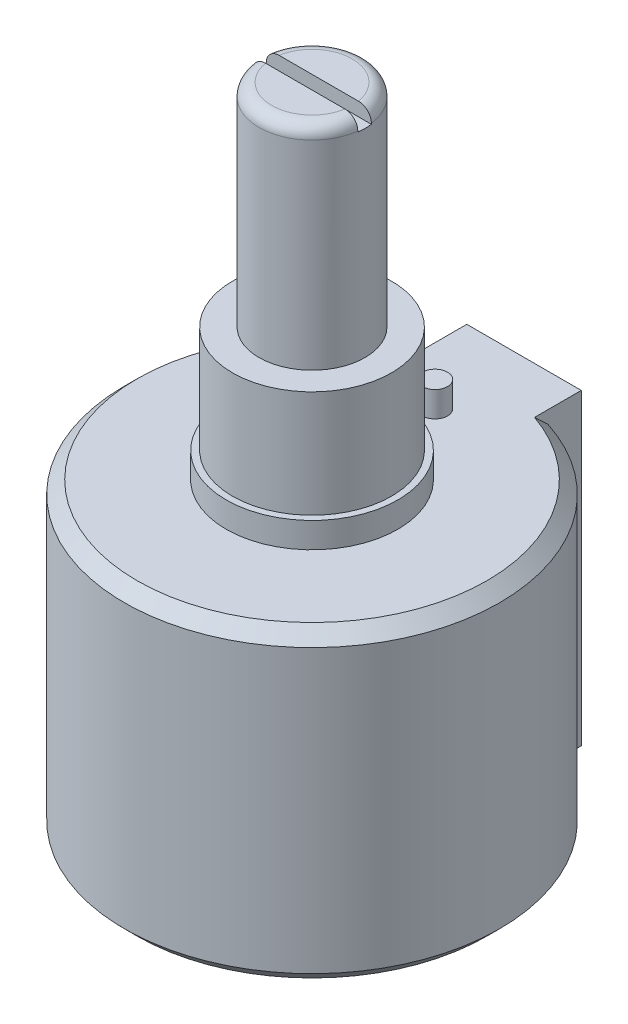
ISO-10303-21;
HEADER;
FILE_DESCRIPTION(('STEP AP214'),'2;1');
FILE_NAME('part.step','',(''),(''),'','','');
FILE_SCHEMA(('AUTOMOTIVE_DESIGN { 1 0 10303 214 1 1 1 1 }'));
ENDSEC;
DATA;
#1=APPLICATION_CONTEXT('core data for automotive mechanical design processes');
#2=APPLICATION_PROTOCOL_DEFINITION('international standard','automotive_design',2000,#1);
#3=PRODUCT_CONTEXT('',#1,'mechanical');
#4=PRODUCT('Part','Part','',(#3));
#5=PRODUCT_RELATED_PRODUCT_CATEGORY('part','',(#4));
#6=PRODUCT_DEFINITION_FORMATION('','',#4);
#7=PRODUCT_DEFINITION_CONTEXT('part definition',#1,'design');
#8=PRODUCT_DEFINITION('design','',#6,#7);
#9=PRODUCT_DEFINITION_SHAPE('','',#8);
#10=(LENGTH_UNIT() NAMED_UNIT(*) SI_UNIT(.MILLI.,.METRE.));
#11=(NAMED_UNIT(*) PLANE_ANGLE_UNIT() SI_UNIT($,.RADIAN.));
#12=(NAMED_UNIT(*) SI_UNIT($,.STERADIAN.) SOLID_ANGLE_UNIT());
#13=UNCERTAINTY_MEASURE_WITH_UNIT(LENGTH_MEASURE(1.E-05),#10,'distance_accuracy_value','');
#14=(GEOMETRIC_REPRESENTATION_CONTEXT(3) GLOBAL_UNCERTAINTY_ASSIGNED_CONTEXT((#13)) GLOBAL_UNIT_ASSIGNED_CONTEXT((#10,
#11,#12)) REPRESENTATION_CONTEXT('',''));
#15=CARTESIAN_POINT('',(0.,0.,0.));
#16=DIRECTION('',(0.,0.,1.));
#17=DIRECTION('',(1.,0.,0.));
#18=AXIS2_PLACEMENT_3D('',#15,#16,#17);
#19=CARTESIAN_POINT('',(0.,39.0652,0.));
#20=DIRECTION('',(0.,1.,0.));
#21=DIRECTION('',(0.,0.,1.));
#22=AXIS2_PLACEMENT_3D('',#19,#20,#21);
#23=PLANE('',#22);
#24=DIRECTION('',(-1.,0.,0.));
#25=VECTOR('',#24,1.);
#26=CARTESIAN_POINT('',(0.,39.0652,-0.406399999999999));
#27=LINE('',#26,#25);
#28=CARTESIAN_POINT('',(2.37853064726944,39.0652,-0.406399999999999));
#29=VERTEX_POINT('',#28);
#30=CARTESIAN_POINT('',(-2.37853064726944,39.0652,-0.406399999999999));
#31=VERTEX_POINT('',#30);
#32=EDGE_CURVE('E155',#29,#31,#27,.T.);
#33=ORIENTED_EDGE('',*,*,#32,.F.);
#34=CARTESIAN_POINT('',(0.,39.0652,0.));
#35=DIRECTION('',(0.,1.,0.));
#36=DIRECTION('',(0.,0.,1.));
#37=AXIS2_PLACEMENT_3D('',#34,#35,#36);
#38=CIRCLE('',#37,2.413);
#39=EDGE_CURVE('E213',#29,#31,#38,.T.);
#40=ORIENTED_EDGE('',*,*,#39,.T.);
#41=EDGE_LOOP('',(#33,#40));
#42=FACE_BOUND('',#41,.T.);
#43=ADVANCED_FACE('F35',(#42),#23,.T.);
#44=CARTESIAN_POINT('',(0.,38.3032,0.));
#45=DIRECTION('',(0.,1.,0.));
#46=DIRECTION('',(0.,0.,1.));
#47=AXIS2_PLACEMENT_3D('',#44,#45,#46);
#48=TOROIDAL_SURFACE('',#47,2.413,0.762);
#49=CARTESIAN_POINT('',(-3.02607236858328,38.7164029158338,-0.406399999999999));
#50=CARTESIAN_POINT('',(-3.04928885546917,38.6807466749942,-0.406399999999999));
#51=CARTESIAN_POINT('',(-3.06952177254155,38.6431123250831,-0.406399999999999));
#52=CARTESIAN_POINT('',(-3.10340243894063,38.5649520848089,-0.406399999999999));
#53=CARTESIAN_POINT('',(-3.11704275529472,38.5244229894951,-0.406399999999999));
#54=CARTESIAN_POINT('',(-3.13731148620609,38.441656801181,-0.406399999999999));
#55=CARTESIAN_POINT('',(-3.14394208031348,38.3994202433294,-0.406399999999999));
#56=CARTESIAN_POINT('',(-3.14999875276988,38.3144444027103,-0.406399999999999));
#57=CARTESIAN_POINT('',(-3.14942653289068,38.2717052410744,-0.406399999999999));
#58=CARTESIAN_POINT('',(-3.14110816073912,38.1870195034577,-0.406399999999999));
#59=CARTESIAN_POINT('',(-3.13337668577192,38.1450714850122,-0.406399999999999));
#60=CARTESIAN_POINT('',(-3.11098766779507,38.0630656787946,-0.406399999999999));
#61=CARTESIAN_POINT('',(-3.09632990074251,38.0230079522134,-0.406399999999999));
#62=CARTESIAN_POINT('',(-3.06049869537566,37.9458710402743,-0.406399999999999));
#63=CARTESIAN_POINT('',(-3.03931845615311,37.9087950150319,-0.406399999999999));
#64=CARTESIAN_POINT('',(-2.99106439466133,37.8387015542637,-0.406399999999999));
#65=CARTESIAN_POINT('',(-2.9639904753045,37.8056841856108,-0.406399999999999));
#66=CARTESIAN_POINT('',(-2.90457459423342,37.7444542670618,-0.406399999999999));
#67=CARTESIAN_POINT('',(-2.87220597123361,37.7162675945424,-0.406399999999999));
#68=CARTESIAN_POINT('',(-2.80323173899145,37.665672404991,-0.406399999999999));
#69=CARTESIAN_POINT('',(-2.76662597473297,37.6432640994581,-0.406399999999999));
#70=CARTESIAN_POINT('',(-2.68987221345261,37.6046422624446,-0.406399999999999));
#71=CARTESIAN_POINT('',(-2.64969561294179,37.5884855873229,-0.406399999999999));
#72=CARTESIAN_POINT('',(-2.5672193662397,37.5630626597329,-0.406399999999999));
#73=CARTESIAN_POINT('',(-2.52491959808366,37.5537968035904,-0.406399999999999));
#74=CARTESIAN_POINT('',(-2.43888661552915,37.5423065115134,-0.406399999999999));
#75=CARTESIAN_POINT('',(-2.39514259224402,37.5401630125027,-0.406399999999999));
#76=CARTESIAN_POINT('',(-2.30790554599542,37.5431669770856,-0.406399999999999));
#77=CARTESIAN_POINT('',(-2.26441253992709,37.5483149258267,-0.406399999999999));
#78=CARTESIAN_POINT('',(-2.17841701660583,37.5658292359713,-0.406399999999999));
#79=CARTESIAN_POINT('',(-2.13593016081474,37.5782725544259,-0.406399999999999));
#80=CARTESIAN_POINT('',(-2.05363029184255,37.6100828070075,-0.406399999999999));
#81=CARTESIAN_POINT('',(-2.01381742730532,37.6294501256533,-0.406399999999999));
#82=CARTESIAN_POINT('',(-1.93783235513034,37.6746804931109,-0.406399999999999));
#83=CARTESIAN_POINT('',(-1.90167667932273,37.7005713391968,-0.406399999999999));
#84=CARTESIAN_POINT('',(-1.83427409464975,37.7581090644821,-0.406399999999999));
#85=CARTESIAN_POINT('',(-1.80302709406933,37.7897558361125,-0.406399999999999));
#86=CARTESIAN_POINT('',(-1.74669129812605,37.857614277476,-0.406399999999999));
#87=CARTESIAN_POINT('',(-1.72154628425541,37.8937792267335,-0.406399999999999));
#88=CARTESIAN_POINT('',(-1.67786484878431,37.9699028421125,-0.406399999999999));
#89=CARTESIAN_POINT('',(-1.65932734621178,38.0098608863375,-0.406399999999999));
#90=CARTESIAN_POINT('',(-1.62989263336655,38.0913793397145,-0.406399999999999));
#91=CARTESIAN_POINT('',(-1.61881730966219,38.1328754154931,-0.406399999999999));
#92=CARTESIAN_POINT('',(-1.60398585541053,38.2171537011806,-0.406399999999999));
#93=CARTESIAN_POINT('',(-1.60022843281929,38.2599356826961,-0.406399999999999));
#94=CARTESIAN_POINT('',(-1.60017256737982,38.3444629135974,-0.406399999999999));
#95=CARTESIAN_POINT('',(-1.60369555269587,38.3862081593499,-0.406399999999999));
#96=CARTESIAN_POINT('',(-1.61771301204883,38.4685087978678,-0.406399999999999));
#97=CARTESIAN_POINT('',(-1.62820738342013,38.5090642081463,-0.406399999999999));
#98=CARTESIAN_POINT('',(-1.65578368392234,38.5878075213604,-0.406399999999999));
#99=CARTESIAN_POINT('',(-1.67285740781917,38.6259983046824,-0.406399999999999));
#100=CARTESIAN_POINT('',(-1.71303654962491,38.6990606583418,-0.406399999999999));
#101=CARTESIAN_POINT('',(-1.73614260586792,38.7339318768738,-0.406399999999999));
#102=CARTESIAN_POINT('',(-1.78827122316134,38.8002133627804,-0.406399999999999));
#103=CARTESIAN_POINT('',(-1.81741523293506,38.8315280796117,-0.406399999999999));
#104=CARTESIAN_POINT('',(-1.88042870975894,38.8889736066399,-0.406399999999999));
#105=CARTESIAN_POINT('',(-1.91429880794966,38.9151037233342,-0.406399999999999));
#106=CARTESIAN_POINT('',(-1.98674918310279,38.9621225560966,-0.406399999999999));
#107=CARTESIAN_POINT('',(-2.02542811277497,38.9828593716224,-0.406399999999999));
#108=CARTESIAN_POINT('',(-2.10568792741015,39.0176387653268,-0.406399999999999));
#109=CARTESIAN_POINT('',(-2.14726904391587,39.0316808086806,-0.406399999999999));
#110=CARTESIAN_POINT('',(-2.23271481332966,39.0528120351898,-0.406399999999999));
#111=CARTESIAN_POINT('',(-2.2766014476288,39.0598124989257,-0.406399999999999));
#112=CARTESIAN_POINT('',(-2.36492659706175,39.0663295317814,-0.406399999999999));
#113=CARTESIAN_POINT('',(-2.40936509216996,39.0658463716741,-0.406399999999999));
#114=CARTESIAN_POINT('',(-2.49742056307014,39.0573844153793,-0.406399999999999));
#115=CARTESIAN_POINT('',(-2.54103920170467,39.0494229642101,-0.406399999999999));
#116=CARTESIAN_POINT('',(-2.62630591778855,39.0262110748465,-0.406399999999999));
#117=CARTESIAN_POINT('',(-2.66795359499146,39.0109591630871,-0.406399999999999));
#118=CARTESIAN_POINT('',(-2.74764509908085,38.9737537432356,-0.406399999999999));
#119=CARTESIAN_POINT('',(-2.78571985214598,38.9518663942123,-0.406399999999999));
#120=CARTESIAN_POINT('',(-2.85755998050462,38.9019521003431,-0.406399999999999));
#121=CARTESIAN_POINT('',(-2.89133078697941,38.8739330170328,-0.406399999999999));
#122=CARTESIAN_POINT('',(-2.94192886776881,38.8240537600922,-0.406399999999999));
#123=CARTESIAN_POINT('',(-2.96037188862817,38.8038047382596,-0.406399999999999));
#124=CARTESIAN_POINT('',(-2.99497866554155,38.7614441200925,-0.406399999999999));
#125=CARTESIAN_POINT('',(-3.01114243704191,38.7393325363821,-0.406399999999999));
#126=CARTESIAN_POINT('',(-3.02607236858328,38.7164029158338,-0.406399999999999));
#127=B_SPLINE_CURVE_WITH_KNOTS('',3,(#49,#50,#51,#52,#53,#54,#55,#56,#57,#58,#59,#60,#61,#62,
#63,#64,#65,#66,#67,#68,#69,#70,#71,#72,#73,#74,#75,#76,#77,#78,#79,#80,#81,#82,#83,#84,#85,#86,
#87,#88,#89,#90,#91,#92,#93,#94,#95,#96,#97,#98,#99,#100,#101,#102,#103,#104,#105,#106,#107,
#108,#109,#110,#111,#112,#113,#114,#115,#116,#117,#118,#119,#120,#121,#122,#123,#124,#125,#126),
.UNSPECIFIED.,.T.,.F.,(4,2,2,2,2,2,2,2,2,2,2,2,2,2,2,2,2,2,2,2,2,2,2,2,2,2,2,2,2,2,2,2,2,2,2,2,
2,2,4),(0.,0.127546111258334,0.255235693648639,0.382885561516224,0.510505270772304,
0.637863922669486,0.765226694484831,0.892722718268354,1.02022084247472,1.14838194526975,
1.27654773833129,1.40585319436798,1.53516608684079,1.66594352703209,1.79672966910768,
1.92892091624898,2.06111950566687,2.19389122274117,2.32666045877704,2.45815560074188,
2.58962922055116,2.71784160035538,2.84603134101103,2.97111422135778,3.09619525968564,
3.22112080931912,3.34605958378477,3.47381011620809,3.60157772530012,3.73262775621915,
3.86368825456944,3.99638009283606,4.12906713004951,4.26144717318124,4.39385398459838,
4.52498177636769,4.65594242316427,4.73796463542026,4.81998629178941),.UNSPECIFIED.);
#128=CARTESIAN_POINT('',(-3.14888298290229,38.3031999999997,-0.406399999999999));
#129=VERTEX_POINT('',#128);
#130=EDGE_CURVE('E247',#31,#129,#127,.T.);
#131=ORIENTED_EDGE('',*,*,#130,.F.);
#132=ORIENTED_EDGE('',*,*,#39,.F.);
#133=CARTESIAN_POINT('',(1.65242579548816,38.5764214201987,-0.406399999999999));
#134=CARTESIAN_POINT('',(1.63709745891226,38.5376639321137,-0.406399999999999));
#135=CARTESIAN_POINT('',(1.62499338654275,38.4976027056279,-0.406399999999999));
#136=CARTESIAN_POINT('',(1.60767124679127,38.4159894106904,-0.406399999999999));
#137=CARTESIAN_POINT('',(1.6024593790779,38.3744360344791,-0.406399999999999));
#138=CARTESIAN_POINT('',(1.59912265765628,38.2910462619487,-0.406399999999999));
#139=CARTESIAN_POINT('',(1.60099705304887,38.2492098960856,-0.406399999999999));
#140=CARTESIAN_POINT('',(1.61176395839783,38.1664605111405,-0.406399999999999));
#141=CARTESIAN_POINT('',(1.62065528931213,38.1255473381241,-0.406399999999999));
#142=CARTESIAN_POINT('',(1.64511467261544,38.0458641332451,-0.406399999999999));
#143=CARTESIAN_POINT('',(1.66066908472458,38.0070899047125,-0.406399999999999));
#144=CARTESIAN_POINT('',(1.69793842456021,37.9326260918949,-0.406399999999999));
#145=CARTESIAN_POINT('',(1.71965411365789,37.8969368895491,-0.406399999999999));
#146=CARTESIAN_POINT('',(1.76908528117237,37.8288580875299,-0.406399999999999));
#147=CARTESIAN_POINT('',(1.79691502461702,37.7965514969802,-0.406399999999999));
#148=CARTESIAN_POINT('',(1.85747610654746,37.7369169608198,-0.406399999999999));
#149=CARTESIAN_POINT('',(1.89020809394345,37.709589675383,-0.406399999999999));
#150=CARTESIAN_POINT('',(1.96058477714417,37.6599459779171,-0.406399999999999));
#151=CARTESIAN_POINT('',(1.99833650666415,37.6377812054057,-0.406399999999999));
#152=CARTESIAN_POINT('',(2.07698591606824,37.5999985621578,-0.406399999999999));
#153=CARTESIAN_POINT('',(2.11788386507077,37.5843812522108,-0.406399999999999));
#154=CARTESIAN_POINT('',(2.20230133377887,37.5599450351813,-0.406399999999999));
#155=CARTESIAN_POINT('',(2.24585000466951,37.5512266683847,-0.406399999999999));
#156=CARTESIAN_POINT('',(2.33379442105477,37.5412295826472,-0.406399999999999));
#157=CARTESIAN_POINT('',(2.37819017596648,37.5399509464626,-0.406399999999999));
#158=CARTESIAN_POINT('',(2.46652845902171,37.5449017114836,-0.406399999999999));
#159=CARTESIAN_POINT('',(2.51047131406582,37.5511252494932,-0.406399999999999));
#160=CARTESIAN_POINT('',(2.59666633498521,37.5709342341448,-0.406399999999999));
#161=CARTESIAN_POINT('',(2.63891857420995,37.5845193610225,-0.406399999999999));
#162=CARTESIAN_POINT('',(2.72009582930016,37.6185343842226,-0.406399999999999));
#163=CARTESIAN_POINT('',(2.75904887098957,37.6388973796156,-0.406399999999999));
#164=CARTESIAN_POINT('',(2.8329279173729,37.6859480876232,-0.406399999999999));
#165=CARTESIAN_POINT('',(2.86785416872345,37.7126354125416,-0.406399999999999));
#166=CARTESIAN_POINT('',(2.93225572168513,37.771240359364,-0.406399999999999));
#167=CARTESIAN_POINT('',(2.96178988350245,37.8030933038939,-0.406399999999999));
#168=CARTESIAN_POINT('',(3.01502716478307,37.8713477547821,-0.406399999999999));
#169=CARTESIAN_POINT('',(3.03873060839244,37.9077490081174,-0.406399999999999));
#170=CARTESIAN_POINT('',(3.079395192496,37.9836808966569,-0.406399999999999));
#171=CARTESIAN_POINT('',(3.0964200626549,38.0231774098234,-0.406399999999999));
#172=CARTESIAN_POINT('',(3.12355016232845,38.1044794362897,-0.406399999999999));
#173=CARTESIAN_POINT('',(3.13365566003718,38.1462848600286,-0.406399999999999));
#174=CARTESIAN_POINT('',(3.14660545412038,38.2307390827149,-0.406399999999999));
#175=CARTESIAN_POINT('',(3.14949444082694,38.2733810344086,-0.406399999999999));
#176=CARTESIAN_POINT('',(3.14805600473704,38.3585426062181,-0.406399999999999));
#177=CARTESIAN_POINT('',(3.14372871611098,38.4010622285936,-0.406399999999999));
#178=CARTESIAN_POINT('',(3.12800226551323,38.4846808142559,-0.406399999999999));
#179=CARTESIAN_POINT('',(3.11661776409481,38.5257825366823,-0.406399999999999));
#180=CARTESIAN_POINT('',(3.08712428579025,38.6054971835315,-0.406399999999999));
#181=CARTESIAN_POINT('',(3.06901528883411,38.6441101005258,-0.406399999999999));
#182=CARTESIAN_POINT('',(3.02655501196972,38.7178462895311,-0.406399999999999));
#183=CARTESIAN_POINT('',(3.00219033326407,38.7529618437829,-0.406399999999999));
#184=CARTESIAN_POINT('',(2.94794514189407,38.8186355481364,-0.406399999999999));
#185=CARTESIAN_POINT('',(2.91806450600758,38.8491935963993,-0.406399999999999));
#186=CARTESIAN_POINT('',(2.85344329658211,38.905095764844,-0.406399999999999));
#187=CARTESIAN_POINT('',(2.81867362919795,38.930406245892,-0.406399999999999));
#188=CARTESIAN_POINT('',(2.74541189830528,38.9748954062823,-0.406399999999999));
#189=CARTESIAN_POINT('',(2.70691966618839,38.9940738077111,-0.406399999999999));
#190=CARTESIAN_POINT('',(2.62690921967996,39.025958498517,-0.406399999999999));
#191=CARTESIAN_POINT('',(2.58536528231656,39.0386002258972,-0.406399999999999));
#192=CARTESIAN_POINT('',(2.50075662044385,39.0568172541728,-0.406399999999999));
#193=CARTESIAN_POINT('',(2.45769180198259,39.0623921177273,-0.406399999999999));
#194=CARTESIAN_POINT('',(2.37073171949045,39.0663830177066,-0.406399999999999));
#195=CARTESIAN_POINT('',(2.32683261409098,39.0647153918988,-0.406399999999999));
#196=CARTESIAN_POINT('',(2.23992280593769,39.054109319368,-0.406399999999999));
#197=CARTESIAN_POINT('',(2.19691212918414,39.045170660163,-0.406399999999999));
#198=CARTESIAN_POINT('',(2.11256160252688,39.0201657622405,-0.406399999999999));
#199=CARTESIAN_POINT('',(2.07124188855732,39.0040315547676,-0.406399999999999));
#200=CARTESIAN_POINT('',(1.99187688651532,38.9650614060755,-0.406399999999999));
#201=CARTESIAN_POINT('',(1.95383255513238,38.9422235153433,-0.406399999999999));
#202=CARTESIAN_POINT('',(1.88206634366501,38.8904194309969,-0.406399999999999));
#203=CARTESIAN_POINT('',(1.84835268960835,38.8614418437747,-0.406399999999999));
#204=CARTESIAN_POINT('',(1.78638407366972,38.7981865282174,-0.406399999999999));
#205=CARTESIAN_POINT('',(1.75812225194169,38.7639155594814,-0.406399999999999));
#206=CARTESIAN_POINT('',(1.71681573966773,38.7039285299407,-0.406399999999999));
#207=CARTESIAN_POINT('',(1.70192165049705,38.6794649438516,-0.406399999999999));
#208=CARTESIAN_POINT('',(1.67498731822836,38.6290127732965,-0.406399999999999));
#209=CARTESIAN_POINT('',(1.66294702872201,38.6030242136383,-0.406399999999999));
#210=CARTESIAN_POINT('',(1.65242579548816,38.5764214201987,-0.406399999999999));
#211=B_SPLINE_CURVE_WITH_KNOTS('',3,(#133,#134,#135,#136,#137,#138,#139,#140,#141,#142,#143,
#144,#145,#146,#147,#148,#149,#150,#151,#152,#153,#154,#155,#156,#157,#158,#159,#160,#161,#162,
#163,#164,#165,#166,#167,#168,#169,#170,#171,#172,#173,#174,#175,#176,#177,#178,#179,#180,#181,
#182,#183,#184,#185,#186,#187,#188,#189,#190,#191,#192,#193,#194,#195,#196,#197,#198,#199,#200,
#201,#202,#203,#204,#205,#206,#207,#208,#209,#210),.UNSPECIFIED.,.T.,.F.,(4,2,2,2,2,2,2,2,2,2,2,
2,2,2,2,2,2,2,2,2,2,2,2,2,2,2,2,2,2,2,2,2,2,2,2,2,2,2,4),(0.,0.124933181615766,0.24997866672436,
0.375010901701927,0.500022132227506,0.624778660782089,0.749550612669976,0.876890047509877,
1.00424635319716,1.13497091122505,1.26570666350957,1.39831427450985,1.53092336057949,
1.66342887544138,1.79592863513903,1.92715753208074,2.05837838646469,2.18806777486038,
2.31774995182656,2.44616265693611,2.57457038450239,2.70218091635919,2.8297890756118,
2.95713302777644,3.08447736001629,3.2120967550956,3.33971900143695,3.46813565720715,
3.59655813215721,3.72622589257648,3.85590167723963,3.98707938230829,4.11826092092926,
4.25070873868999,4.3831951121196,4.51592953199756,4.64849583163145,4.73425024557416,
4.82000326488688),.UNSPECIFIED.);
#212=CARTESIAN_POINT('',(3.14888298290044,38.3032,-0.406399999999999));
#213=VERTEX_POINT('',#212);
#214=EDGE_CURVE('E243',#213,#29,#211,.T.);
#215=ORIENTED_EDGE('',*,*,#214,.F.);
#216=CARTESIAN_POINT('',(0.,38.3032,0.));
#217=DIRECTION('',(0.,1.,0.));
#218=DIRECTION('',(0.,0.,1.));
#219=AXIS2_PLACEMENT_3D('',#216,#217,#218);
#220=CIRCLE('',#219,3.175);
#221=EDGE_CURVE('E215',#129,#213,#220,.F.);
#222=ORIENTED_EDGE('',*,*,#221,.F.);
#223=EDGE_LOOP('',(#131,#132,#215,#222));
#224=FACE_BOUND('',#223,.T.);
#225=ADVANCED_FACE('F282',(#224),#48,.T.);
#226=CARTESIAN_POINT('',(0.,26.3652,0.));
#227=DIRECTION('',(0.,1.,0.));
#228=DIRECTION('',(0.,0.,1.));
#229=AXIS2_PLACEMENT_3D('',#226,#227,#228);
#230=PLANE('',#229);
#231=CARTESIAN_POINT('',(0.,26.3652,0.));
#232=DIRECTION('',(0.,1.,0.));
#233=DIRECTION('',(0.,0.,1.));
#234=AXIS2_PLACEMENT_3D('',#231,#232,#233);
#235=CIRCLE('',#234,4.7625);
#236=CARTESIAN_POINT('',(0.,26.3652,4.7625));
#237=VERTEX_POINT('',#236);
#238=EDGE_CURVE('E171',#237,#237,#235,.T.);
#239=ORIENTED_EDGE('',*,*,#238,.T.);
#240=EDGE_LOOP('',(#239));
#241=FACE_BOUND('',#240,.T.);
#242=CARTESIAN_POINT('',(0.,26.3652,0.));
#243=DIRECTION('',(0.,1.,0.));
#244=DIRECTION('',(0.,0.,1.));
#245=AXIS2_PLACEMENT_3D('',#242,#243,#244);
#246=CIRCLE('',#245,3.175);
#247=CARTESIAN_POINT('',(0.,26.3652,3.175));
#248=VERTEX_POINT('',#247);
#249=EDGE_CURVE('E167',#248,#248,#246,.T.);
#250=ORIENTED_EDGE('',*,*,#249,.F.);
#251=EDGE_LOOP('',(#250));
#252=FACE_BOUND('',#251,.T.);
#253=ADVANCED_FACE('F287',(#241,#252),#230,.T.);
#254=CARTESIAN_POINT('',(0.,19.9644,0.));
#255=DIRECTION('',(0.,1.,0.));
#256=DIRECTION('',(0.,0.,1.));
#257=AXIS2_PLACEMENT_3D('',#254,#255,#256);
#258=PLANE('',#257);
#259=CARTESIAN_POINT('',(0.,19.9644,0.));
#260=DIRECTION('',(0.,1.,0.));
#261=DIRECTION('',(0.,0.,1.));
#262=AXIS2_PLACEMENT_3D('',#259,#260,#261);
#263=CIRCLE('',#262,5.1435);
#264=CARTESIAN_POINT('',(0.,19.9644,5.1435));
#265=VERTEX_POINT('',#264);
#266=EDGE_CURVE('E183',#265,#265,#263,.T.);
#267=ORIENTED_EDGE('',*,*,#266,.T.);
#268=EDGE_LOOP('',(#267));
#269=FACE_BOUND('',#268,.T.);
#270=CARTESIAN_POINT('',(0.,19.9644,0.));
#271=DIRECTION('',(0.,1.,0.));
#272=DIRECTION('',(0.,0.,1.));
#273=AXIS2_PLACEMENT_3D('',#270,#271,#272);
#274=CIRCLE('',#273,4.7625);
#275=CARTESIAN_POINT('',(0.,19.9644,4.7625));
#276=VERTEX_POINT('',#275);
#277=EDGE_CURVE('E170',#276,#276,#274,.T.);
#278=ORIENTED_EDGE('',*,*,#277,.F.);
#279=EDGE_LOOP('',(#278));
#280=FACE_BOUND('',#279,.T.);
#281=ADVANCED_FACE('F316',(#269,#280),#258,.T.);
#282=CARTESIAN_POINT('',(0.,18.4404,0.));
#283=DIRECTION('',(0.,1.,0.));
#284=DIRECTION('',(0.,0.,1.));
#285=AXIS2_PLACEMENT_3D('',#282,#283,#284);
#286=PLANE('',#285);
#287=CARTESIAN_POINT('',(0.,18.4404,0.));
#288=DIRECTION('',(0.,1.,0.));
#289=DIRECTION('',(0.,0.,1.));
#290=AXIS2_PLACEMENT_3D('',#287,#288,#289);
#291=CIRCLE('',#290,5.1435);
#292=CARTESIAN_POINT('',(0.,18.4404,5.1435));
#293=VERTEX_POINT('',#292);
#294=EDGE_CURVE('E180',#293,#293,#291,.T.);
#295=ORIENTED_EDGE('',*,*,#294,.F.);
#296=EDGE_LOOP('',(#295));
#297=FACE_BOUND('',#296,.T.);
#298=CARTESIAN_POINT('',(0.,18.4404,0.));
#299=DIRECTION('',(0.,1.,0.));
#300=DIRECTION('',(0.,0.,1.));
#301=AXIS2_PLACEMENT_3D('',#298,#299,#300);
#302=CIRCLE('',#301,10.4775);
#303=CARTESIAN_POINT('',(-3.429,18.4404,-9.90050328266197));
#304=VERTEX_POINT('',#303);
#305=CARTESIAN_POINT('',(3.429,18.4404,-9.90050328266197));
#306=VERTEX_POINT('',#305);
#307=EDGE_CURVE('E140',#304,#306,#302,.T.);
#308=ORIENTED_EDGE('',*,*,#307,.T.);
#309=DIRECTION('',(0.,0.,-1.));
#310=VECTOR('',#309,1.);
#311=CARTESIAN_POINT('',(3.429,18.4404,-12.7));
#312=LINE('',#311,#310);
#313=CARTESIAN_POINT('',(3.429,18.4404,-12.7));
#314=VERTEX_POINT('',#313);
#315=EDGE_CURVE('E188',#306,#314,#312,.T.);
#316=ORIENTED_EDGE('',*,*,#315,.T.);
#317=DIRECTION('',(-1.,0.,0.));
#318=VECTOR('',#317,1.);
#319=CARTESIAN_POINT('',(3.429,18.4404,-12.7));
#320=LINE('',#319,#318);
#321=CARTESIAN_POINT('',(-3.429,18.4404,-12.7));
#322=VERTEX_POINT('',#321);
#323=EDGE_CURVE('E191',#314,#322,#320,.T.);
#324=ORIENTED_EDGE('',*,*,#323,.T.);
#325=DIRECTION('',(0.,0.,1.));
#326=VECTOR('',#325,1.);
#327=CARTESIAN_POINT('',(-3.429,18.4404,-12.7));
#328=LINE('',#327,#326);
#329=EDGE_CURVE('E193',#322,#304,#328,.T.);
#330=ORIENTED_EDGE('',*,*,#329,.T.);
#331=EDGE_LOOP('',(#308,#316,#324,#330));
#332=FACE_BOUND('',#331,.T.);
#333=CARTESIAN_POINT('',(0.,18.4404,-7.366));
#334=DIRECTION('',(0.,1.,0.));
#335=DIRECTION('',(0.,0.,1.));
#336=AXIS2_PLACEMENT_3D('',#333,#334,#335);
#337=CIRCLE('',#336,0.7493);
#338=CARTESIAN_POINT('',(0.,18.4404,-6.6167));
#339=VERTEX_POINT('',#338);
#340=EDGE_CURVE('E174',#339,#339,#337,.T.);
#341=ORIENTED_EDGE('',*,*,#340,.F.);
#342=EDGE_LOOP('',(#341));
#343=FACE_BOUND('',#342,.T.);
#344=ADVANCED_FACE('F329',(#297,#332,#343),#286,.T.);
#345=CARTESIAN_POINT('',(3.429,18.4404,-12.7));
#346=DIRECTION('',(-1.,0.,0.));
#347=DIRECTION('',(0.,0.,1.));
#348=AXIS2_PLACEMENT_3D('',#345,#346,#347);
#349=PLANE('',#348);
#350=DIRECTION('',(0.,0.,-1.));
#351=VECTOR('',#350,1.);
#352=CARTESIAN_POINT('',(3.429,0.,-12.7));
#353=LINE('',#352,#351);
#354=CARTESIAN_POINT('',(3.429,0.,-9.90050328266195));
#355=VERTEX_POINT('',#354);
#356=CARTESIAN_POINT('',(3.429,0.,-12.7));
#357=VERTEX_POINT('',#356);
#358=EDGE_CURVE('E55',#355,#357,#353,.T.);
#359=ORIENTED_EDGE('',*,*,#358,.T.);
#360=DIRECTION('',(0.,-1.,0.));
#361=VECTOR('',#360,1.);
#362=CARTESIAN_POINT('',(3.429,18.4404,-12.7));
#363=LINE('',#362,#361);
#364=EDGE_CURVE('E207',#314,#357,#363,.T.);
#365=ORIENTED_EDGE('',*,*,#364,.F.);
#366=ORIENTED_EDGE('',*,*,#315,.F.);
#367=CARTESIAN_POINT('',(3.429,18.4404,-9.90050328266197));
#368=CARTESIAN_POINT('',(3.429,18.3136601634993,-10.0346094347289));
#369=CARTESIAN_POINT('',(3.429,18.1867902431403,-10.1685921687848));
#370=CARTESIAN_POINT('',(3.429,17.9327902431231,-10.4363107920026));
#371=CARTESIAN_POINT('',(3.429,17.805660163482,-10.570046681181));
#372=CARTESIAN_POINT('',(3.429,17.6784,-10.7036591523647));
#373=B_SPLINE_CURVE_WITH_KNOTS('',3,(#367,#368,#369,#370,#371,#372),.UNSPECIFIED.,.F.,.F.,(4,2,
4),(0.,0.553557718266879,1.10711539984552),.UNSPECIFIED.);
#374=CARTESIAN_POINT('',(3.42899999999999,17.6784,-10.7036591523647));
#375=VERTEX_POINT('',#374);
#376=EDGE_CURVE('E260',#306,#375,#373,.T.);
#377=ORIENTED_EDGE('',*,*,#376,.T.);
#378=DIRECTION('',(0.,-1.,0.));
#379=VECTOR('',#378,1.);
#380=CARTESIAN_POINT('',(3.42899999999999,18.4404,-10.7036591523647));
#381=LINE('',#380,#379);
#382=CARTESIAN_POINT('',(3.42899999999999,0.761999999999995,-10.7036591523647));
#383=VERTEX_POINT('',#382);
#384=EDGE_CURVE('E195',#375,#383,#381,.T.);
#385=ORIENTED_EDGE('',*,*,#384,.T.);
#386=CARTESIAN_POINT('',(3.42899999999999,0.761999999999995,-10.7036591523647));
#387=CARTESIAN_POINT('',(3.429,0.634739836517968,-10.570046681181));
#388=CARTESIAN_POINT('',(3.429,0.507609756876945,-10.4363107920026));
#389=CARTESIAN_POINT('',(3.429,0.253609756859703,-10.1685921687848));
#390=CARTESIAN_POINT('',(3.429,0.126739836500728,-10.0346094347289));
#391=CARTESIAN_POINT('',(3.429,0.,-9.90050328266195));
#392=B_SPLINE_CURVE_WITH_KNOTS('',3,(#386,#387,#388,#389,#390,#391),.UNSPECIFIED.,.F.,.F.,(4,2,
4),(0.,0.553557681578648,1.10711539984554),.UNSPECIFIED.);
#393=EDGE_CURVE('E48',#383,#355,#392,.T.);
#394=ORIENTED_EDGE('',*,*,#393,.T.);
#395=EDGE_LOOP('',(#359,#365,#366,#377,#385,#394));
#396=FACE_BOUND('',#395,.T.);
#397=ADVANCED_FACE('F269',(#396),#349,.F.);
#398=CARTESIAN_POINT('',(3.429,18.4404,-12.7));
#399=DIRECTION('',(0.,0.,1.));
#400=DIRECTION('',(1.,0.,0.));
#401=AXIS2_PLACEMENT_3D('',#398,#399,#400);
#402=PLANE('',#401);
#403=DIRECTION('',(-1.,0.,0.));
#404=VECTOR('',#403,1.);
#405=CARTESIAN_POINT('',(3.429,0.,-12.7));
#406=LINE('',#405,#404);
#407=CARTESIAN_POINT('',(-3.429,0.,-12.7));
#408=VERTEX_POINT('',#407);
#409=EDGE_CURVE('E197',#357,#408,#406,.T.);
#410=ORIENTED_EDGE('',*,*,#409,.T.);
#411=DIRECTION('',(0.,-1.,0.));
#412=VECTOR('',#411,1.);
#413=CARTESIAN_POINT('',(-3.429,18.4404,-12.7));
#414=LINE('',#413,#412);
#415=EDGE_CURVE('E205',#322,#408,#414,.T.);
#416=ORIENTED_EDGE('',*,*,#415,.F.);
#417=ORIENTED_EDGE('',*,*,#323,.F.);
#418=ORIENTED_EDGE('',*,*,#364,.T.);
#419=EDGE_LOOP('',(#410,#416,#417,#418));
#420=FACE_BOUND('',#419,.T.);
#421=ADVANCED_FACE('F346',(#420),#402,.F.);
#422=CARTESIAN_POINT('',(-3.429,18.4404,-12.7));
#423=DIRECTION('',(1.,0.,0.));
#424=DIRECTION('',(0.,0.,-1.));
#425=AXIS2_PLACEMENT_3D('',#422,#423,#424);
#426=PLANE('',#425);
#427=DIRECTION('',(0.,0.,1.));
#428=VECTOR('',#427,1.);
#429=CARTESIAN_POINT('',(-3.429,0.,-12.7));
#430=LINE('',#429,#428);
#431=CARTESIAN_POINT('',(-3.429,0.,-9.90050328266195));
#432=VERTEX_POINT('',#431);
#433=EDGE_CURVE('E62',#408,#432,#430,.T.);
#434=ORIENTED_EDGE('',*,*,#433,.T.);
#435=CARTESIAN_POINT('',(-3.429,0.,-9.90050328266195));
#436=CARTESIAN_POINT('',(-3.429,0.126739836500728,-10.0346094347289));
#437=CARTESIAN_POINT('',(-3.429,0.253609756859702,-10.1685921687848));
#438=CARTESIAN_POINT('',(-3.429,0.507609756876944,-10.4363107920026));
#439=CARTESIAN_POINT('',(-3.429,0.634739836517967,-10.570046681181));
#440=CARTESIAN_POINT('',(-3.429,0.761999999999995,-10.7036591523647));
#441=B_SPLINE_CURVE_WITH_KNOTS('',3,(#435,#436,#437,#438,#439,#440),.UNSPECIFIED.,.F.,.F.,(4,2,
4),(0.,0.553557718266886,1.10711539984553),.UNSPECIFIED.);
#442=CARTESIAN_POINT('',(-3.429,0.761999999999995,-10.7036591523647));
#443=VERTEX_POINT('',#442);
#444=EDGE_CURVE('E11',#432,#443,#441,.T.);
#445=ORIENTED_EDGE('',*,*,#444,.T.);
#446=DIRECTION('',(0.,-1.,0.));
#447=VECTOR('',#446,1.);
#448=CARTESIAN_POINT('',(-3.429,18.4404,-10.7036591523647));
#449=LINE('',#448,#447);
#450=CARTESIAN_POINT('',(-3.429,17.6784,-10.7036591523647));
#451=VERTEX_POINT('',#450);
#452=EDGE_CURVE('E202',#451,#443,#449,.T.);
#453=ORIENTED_EDGE('',*,*,#452,.F.);
#454=CARTESIAN_POINT('',(-3.429,17.6784,-10.7036591523647));
#455=CARTESIAN_POINT('',(-3.429,17.805660163482,-10.570046681181));
#456=CARTESIAN_POINT('',(-3.429,17.9327902431231,-10.4363107920026));
#457=CARTESIAN_POINT('',(-3.429,18.1867902431403,-10.1685921687848));
#458=CARTESIAN_POINT('',(-3.429,18.3136601634993,-10.0346094347289));
#459=CARTESIAN_POINT('',(-3.429,18.4404,-9.90050328266197));
#460=B_SPLINE_CURVE_WITH_KNOTS('',3,(#454,#455,#456,#457,#458,#459),.UNSPECIFIED.,.F.,.F.,(4,2,
4),(0.,0.553557681578641,1.10711539984552),.UNSPECIFIED.);
#461=EDGE_CURVE('E265',#451,#304,#460,.T.);
#462=ORIENTED_EDGE('',*,*,#461,.T.);
#463=ORIENTED_EDGE('',*,*,#329,.F.);
#464=ORIENTED_EDGE('',*,*,#415,.T.);
#465=EDGE_LOOP('',(#434,#445,#453,#462,#463,#464));
#466=FACE_BOUND('',#465,.T.);
#467=ADVANCED_FACE('F342',(#466),#426,.F.);
#468=CARTESIAN_POINT('',(0.,18.4404,0.));
#469=DIRECTION('',(0.,-1.,0.));
#470=DIRECTION('',(0.,0.,-1.));
#471=AXIS2_PLACEMENT_3D('',#468,#469,#470);
#472=CYLINDRICAL_SURFACE('',#471,11.2395);
#473=ORIENTED_EDGE('',*,*,#384,.F.);
#474=CARTESIAN_POINT('',(0.,17.6784,0.));
#475=DIRECTION('',(0.,1.,0.));
#476=DIRECTION('',(0.,0.,1.));
#477=AXIS2_PLACEMENT_3D('',#474,#475,#476);
#478=CIRCLE('',#477,11.2395);
#479=EDGE_CURVE('E256',#375,#451,#478,.F.);
#480=ORIENTED_EDGE('',*,*,#479,.T.);
#481=ORIENTED_EDGE('',*,*,#452,.T.);
#482=CARTESIAN_POINT('',(0.,0.761999999999995,0.));
#483=DIRECTION('',(0.,1.,0.));
#484=DIRECTION('',(0.,0.,1.));
#485=AXIS2_PLACEMENT_3D('',#482,#483,#484);
#486=CIRCLE('',#485,11.2395);
#487=EDGE_CURVE('E253',#443,#383,#486,.T.);
#488=ORIENTED_EDGE('',*,*,#487,.T.);
#489=EDGE_LOOP('',(#473,#480,#481,#488));
#490=FACE_BOUND('',#489,.T.);
#491=ADVANCED_FACE('F340',(#490),#472,.T.);
#492=CARTESIAN_POINT('',(0.,0.,0.));
#493=DIRECTION('',(0.,1.,0.));
#494=DIRECTION('',(0.,0.,1.));
#495=AXIS2_PLACEMENT_3D('',#492,#493,#494);
#496=PLANE('',#495);
#497=ORIENTED_EDGE('',*,*,#358,.F.);
#498=CARTESIAN_POINT('',(0.,0.,0.));
#499=DIRECTION('',(0.,1.,0.));
#500=DIRECTION('',(0.,0.,1.));
#501=AXIS2_PLACEMENT_3D('',#498,#499,#500);
#502=CIRCLE('',#501,10.4775);
#503=EDGE_CURVE('E258',#355,#432,#502,.F.);
#504=ORIENTED_EDGE('',*,*,#503,.T.);
#505=ORIENTED_EDGE('',*,*,#433,.F.);
#506=ORIENTED_EDGE('',*,*,#409,.F.);
#507=EDGE_LOOP('',(#497,#504,#505,#506));
#508=FACE_BOUND('',#507,.T.);
#509=ADVANCED_FACE('F333',(#508),#496,.F.);
#510=CARTESIAN_POINT('',(0.,19.9644,0.));
#511=DIRECTION('',(0.,-1.,0.));
#512=DIRECTION('',(0.,0.,-1.));
#513=AXIS2_PLACEMENT_3D('',#510,#511,#512);
#514=CYLINDRICAL_SURFACE('',#513,5.1435);
#515=ORIENTED_EDGE('',*,*,#266,.F.);
#516=EDGE_LOOP('',(#515));
#517=FACE_BOUND('',#516,.T.);
#518=ORIENTED_EDGE('',*,*,#294,.T.);
#519=EDGE_LOOP('',(#518));
#520=FACE_BOUND('',#519,.T.);
#521=ADVANCED_FACE('F325',(#517,#520),#514,.T.);
#522=CARTESIAN_POINT('',(0.,19.9644,-7.366));
#523=DIRECTION('',(0.,-1.,0.));
#524=DIRECTION('',(0.,0.,-1.));
#525=AXIS2_PLACEMENT_3D('',#522,#523,#524);
#526=CYLINDRICAL_SURFACE('',#525,0.7493);
#527=CARTESIAN_POINT('',(0.,19.9644,-7.366));
#528=DIRECTION('',(0.,1.,0.));
#529=DIRECTION('',(0.,0.,1.));
#530=AXIS2_PLACEMENT_3D('',#527,#528,#529);
#531=CIRCLE('',#530,0.7493);
#532=CARTESIAN_POINT('',(0.,19.9644,-6.6167));
#533=VERTEX_POINT('',#532);
#534=EDGE_CURVE('E177',#533,#533,#531,.T.);
#535=ORIENTED_EDGE('',*,*,#534,.F.);
#536=EDGE_LOOP('',(#535));
#537=FACE_BOUND('',#536,.T.);
#538=ORIENTED_EDGE('',*,*,#340,.T.);
#539=EDGE_LOOP('',(#538));
#540=FACE_BOUND('',#539,.T.);
#541=ADVANCED_FACE('F321',(#537,#540),#526,.T.);
#542=CARTESIAN_POINT('',(0.,19.9644,-7.366));
#543=DIRECTION('',(0.,1.,0.));
#544=DIRECTION('',(0.,0.,1.));
#545=AXIS2_PLACEMENT_3D('',#542,#543,#544);
#546=PLANE('',#545);
#547=ORIENTED_EDGE('',*,*,#534,.T.);
#548=EDGE_LOOP('',(#547));
#549=FACE_BOUND('',#548,.T.);
#550=ADVANCED_FACE('F311',(#549),#546,.T.);
#551=CARTESIAN_POINT('',(0.,26.3652,0.));
#552=DIRECTION('',(0.,-1.,0.));
#553=DIRECTION('',(0.,0.,-1.));
#554=AXIS2_PLACEMENT_3D('',#551,#552,#553);
#555=CYLINDRICAL_SURFACE('',#554,4.7625);
#556=ORIENTED_EDGE('',*,*,#238,.F.);
#557=EDGE_LOOP('',(#556));
#558=FACE_BOUND('',#557,.T.);
#559=ORIENTED_EDGE('',*,*,#277,.T.);
#560=EDGE_LOOP('',(#559));
#561=FACE_BOUND('',#560,.T.);
#562=ADVANCED_FACE('F297',(#558,#561),#555,.T.);
#563=CARTESIAN_POINT('',(0.,39.0652,0.));
#564=DIRECTION('',(0.,-1.,0.));
#565=DIRECTION('',(0.,0.,-1.));
#566=AXIS2_PLACEMENT_3D('',#563,#564,#565);
#567=CYLINDRICAL_SURFACE('',#566,3.175);
#568=CARTESIAN_POINT('',(0.,38.2524,0.));
#569=DIRECTION('',(0.,-1.,0.));
#570=DIRECTION('',(0.,0.,-1.));
#571=AXIS2_PLACEMENT_3D('',#568,#569,#570);
#572=CIRCLE('',#571,3.175);
#573=CARTESIAN_POINT('',(-3.14888298290044,38.2524,0.406400000000001));
#574=VERTEX_POINT('',#573);
#575=CARTESIAN_POINT('',(-3.14888298290044,38.2524,-0.406399999999999));
#576=VERTEX_POINT('',#575);
#577=EDGE_CURVE('E130',#574,#576,#572,.T.);
#578=ORIENTED_EDGE('',*,*,#577,.T.);
#579=DIRECTION('',(0.,-1.,0.));
#580=VECTOR('',#579,1.);
#581=CARTESIAN_POINT('',(-3.14888298290044,39.0652,-0.406399999999999));
#582=LINE('',#581,#580);
#583=EDGE_CURVE('E165',#576,#129,#582,.F.);
#584=ORIENTED_EDGE('',*,*,#583,.T.);
#585=ORIENTED_EDGE('',*,*,#221,.T.);
#586=DIRECTION('',(0.,-1.,0.));
#587=VECTOR('',#586,1.);
#588=CARTESIAN_POINT('',(3.14888298290044,39.0652,-0.406399999999999));
#589=LINE('',#588,#587);
#590=CARTESIAN_POINT('',(3.14888298290044,38.2524,-0.406399999999999));
#591=VERTEX_POINT('',#590);
#592=EDGE_CURVE('E157',#213,#591,#589,.T.);
#593=ORIENTED_EDGE('',*,*,#592,.T.);
#594=CARTESIAN_POINT('',(3.14888298290044,38.2524,0.406400000000001));
#595=VERTEX_POINT('',#594);
#596=EDGE_CURVE('E141',#591,#595,#572,.T.);
#597=ORIENTED_EDGE('',*,*,#596,.T.);
#598=DIRECTION('',(0.,-1.,0.));
#599=VECTOR('',#598,1.);
#600=CARTESIAN_POINT('',(3.14888298290044,39.0652,0.406400000000001));
#601=LINE('',#600,#599);
#602=CARTESIAN_POINT('',(3.14888298290046,38.3032,0.406400000000001));
#603=VERTEX_POINT('',#602);
#604=EDGE_CURVE('E148',#595,#603,#601,.F.);
#605=ORIENTED_EDGE('',*,*,#604,.T.);
#606=CARTESIAN_POINT('',(-3.14888298290044,38.3032,0.406400000000001));
#607=VERTEX_POINT('',#606);
#608=EDGE_CURVE('E154',#603,#607,#220,.F.);
#609=ORIENTED_EDGE('',*,*,#608,.T.);
#610=DIRECTION('',(0.,-1.,0.));
#611=VECTOR('',#610,1.);
#612=CARTESIAN_POINT('',(-3.14888298290044,39.0652,0.406400000000001));
#613=LINE('',#612,#611);
#614=EDGE_CURVE('E145',#607,#574,#613,.T.);
#615=ORIENTED_EDGE('',*,*,#614,.T.);
#616=EDGE_LOOP('',(#578,#584,#585,#593,#597,#605,#609,#615));
#617=FACE_BOUND('',#616,.T.);
#618=ORIENTED_EDGE('',*,*,#249,.T.);
#619=EDGE_LOOP('',(#618));
#620=FACE_BOUND('',#619,.T.);
#621=ADVANCED_FACE('F151',(#617,#620),#567,.T.);
#622=DIRECTION('',(1.,0.,0.));
#623=VECTOR('',#622,1.);
#624=CARTESIAN_POINT('',(0.,39.0652,0.406400000000001));
#625=LINE('',#624,#623);
#626=CARTESIAN_POINT('',(-2.37853064726944,39.0652,0.406400000000001));
#627=VERTEX_POINT('',#626);
#628=CARTESIAN_POINT('',(2.37853064726944,39.0652,0.406400000000001));
#629=VERTEX_POINT('',#628);
#630=EDGE_CURVE('E159',#627,#629,#625,.T.);
#631=ORIENTED_EDGE('',*,*,#630,.F.);
#632=EDGE_CURVE('E210',#627,#629,#38,.T.);
#633=ORIENTED_EDGE('',*,*,#632,.T.);
#634=EDGE_LOOP('',(#631,#633));
#635=FACE_BOUND('',#634,.T.);
#636=ADVANCED_FACE('F240',(#635),#23,.T.);
#637=CARTESIAN_POINT('',(-3.02607236858328,38.7164029158338,0.406400000000001));
#638=CARTESIAN_POINT('',(-3.00260544106068,38.7524366572212,0.406400000000001));
#639=CARTESIAN_POINT('',(-2.97605636507748,38.7865026931576,0.406400000000001));
#640=CARTESIAN_POINT('',(-2.91757844828613,38.849706944623,0.406400000000001));
#641=CARTESIAN_POINT('',(-2.88564267694115,38.8788387136889,0.406400000000001));
#642=CARTESIAN_POINT('',(-2.81736867238437,38.9313148325351,0.406400000000001));
#643=CARTESIAN_POINT('',(-2.78103440543679,38.954664339337,0.406400000000001));
#644=CARTESIAN_POINT('',(-2.70499641210443,38.9949771771711,0.406400000000001));
#645=CARTESIAN_POINT('',(-2.6652935163025,39.0119420768429,0.406400000000001));
#646=CARTESIAN_POINT('',(-2.58331395563606,39.0391677234961,0.406400000000001));
#647=CARTESIAN_POINT('',(-2.54101987269984,39.049376005722,0.406400000000001));
#648=CARTESIAN_POINT('',(-2.45532315634861,39.062636376969,0.406400000000001));
#649=CARTESIAN_POINT('',(-2.41192040998105,39.0656877338667,0.406400000000001));
#650=CARTESIAN_POINT('',(-2.32470381994393,39.0645792111535,0.406400000000001));
#651=CARTESIAN_POINT('',(-2.28089103964726,39.0603353705801,0.406400000000001));
#652=CARTESIAN_POINT('',(-2.19458058275008,39.0446204803639,0.406400000000001));
#653=CARTESIAN_POINT('',(-2.15208299102543,39.0331489652984,0.406400000000001));
#654=CARTESIAN_POINT('',(-2.06921729128659,39.0031733444337,0.406400000000001));
#655=CARTESIAN_POINT('',(-2.02887133849846,38.9846079442457,0.406400000000001));
#656=CARTESIAN_POINT('',(-1.95186817729939,38.9409630225318,0.406400000000001));
#657=CARTESIAN_POINT('',(-1.91521108876803,38.9158832893998,0.406400000000001));
#658=CARTESIAN_POINT('',(-1.84669330900352,38.8599098119691,0.406400000000001));
#659=CARTESIAN_POINT('',(-1.8148283281397,38.8290213237725,0.406400000000001));
#660=CARTESIAN_POINT('',(-1.75684171587948,38.7622521723718,0.406400000000001));
#661=CARTESIAN_POINT('',(-1.73071962820029,38.7263719061431,0.406400000000001));
#662=CARTESIAN_POINT('',(-1.68547235460761,38.651266232567,0.406400000000001));
#663=CARTESIAN_POINT('',(-1.6662362088286,38.6121077348476,0.406400000000001));
#664=CARTESIAN_POINT('',(-1.63482503963526,38.5310546707249,0.406400000000001));
#665=CARTESIAN_POINT('',(-1.62264860876905,38.48916065154,0.406400000000001));
#666=CARTESIAN_POINT('',(-1.60604030814873,38.4050639220462,0.406400000000001));
#667=CARTESIAN_POINT('',(-1.60140455448239,38.3629014262838,0.406400000000001));
#668=CARTESIAN_POINT('',(-1.59940799020672,38.2784068918472,0.406400000000001));
#669=CARTESIAN_POINT('',(-1.60204635208287,38.2360748730053,0.406400000000001));
#670=CARTESIAN_POINT('',(-1.61439632902299,38.1531631963824,0.406400000000001));
#671=CARTESIAN_POINT('',(-1.6239925313825,38.1125662528758,0.406400000000001));
#672=CARTESIAN_POINT('',(-1.64979288184075,38.0335319383244,0.406400000000001));
#673=CARTESIAN_POINT('',(-1.66599736122015,37.9950946756569,0.406400000000001));
#674=CARTESIAN_POINT('',(-1.70469235305446,37.9210011893109,0.406400000000001));
#675=CARTESIAN_POINT('',(-1.72724879759317,37.8853794434315,0.406400000000001));
#676=CARTESIAN_POINT('',(-1.7778742027459,37.8182977898707,0.406400000000001));
#677=CARTESIAN_POINT('',(-1.80594387576033,37.7868384209174,0.406400000000001));
#678=CARTESIAN_POINT('',(-1.86760545067837,37.7280857651451,0.406400000000001));
#679=CARTESIAN_POINT('',(-1.9013249253178,37.7009263430302,0.406400000000001));
#680=CARTESIAN_POINT('',(-1.97276610884923,37.6525128382305,0.406400000000001));
#681=CARTESIAN_POINT('',(-2.01048827924882,37.6312594375297,0.406400000000001));
#682=CARTESIAN_POINT('',(-2.08972725488381,37.5948280916838,0.406400000000001));
#683=CARTESIAN_POINT('',(-2.13130714029029,37.5797871931479,0.406400000000001));
#684=CARTESIAN_POINT('',(-2.21639509690386,37.5568550316808,0.406400000000001));
#685=CARTESIAN_POINT('',(-2.25990325364331,37.5489640862338,0.406400000000001));
#686=CARTESIAN_POINT('',(-2.34787001927498,37.5405505516654,0.406400000000001));
#687=CARTESIAN_POINT('',(-2.39233253380167,37.5400686367665,0.406400000000001));
#688=CARTESIAN_POINT('',(-2.48070043076799,37.5466276932915,0.406400000000001));
#689=CARTESIAN_POINT('',(-2.52460582703644,37.5536684776151,0.406400000000001));
#690=CARTESIAN_POINT('',(-2.61029800296228,37.5750406055222,0.406400000000001));
#691=CARTESIAN_POINT('',(-2.65209686272734,37.5893234779005,0.406400000000001));
#692=CARTESIAN_POINT('',(-2.73266094076839,37.624784071001,0.406400000000001));
#693=CARTESIAN_POINT('',(-2.77142632620106,37.6459614114777,0.406400000000001));
#694=CARTESIAN_POINT('',(-2.84434989679365,37.6943511437674,0.406400000000001));
#695=CARTESIAN_POINT('',(-2.87855560150732,37.7214919217753,0.406400000000001));
#696=CARTESIAN_POINT('',(-2.94186105959423,37.7811889751203,0.406400000000001));
#697=CARTESIAN_POINT('',(-2.97096111056298,37.8137449346047,0.406400000000001));
#698=CARTESIAN_POINT('',(-3.02289636188278,37.8829624839206,0.406400000000001));
#699=CARTESIAN_POINT('',(-3.0457965415557,37.9195753262302,0.406400000000001));
#700=CARTESIAN_POINT('',(-3.08506688201959,37.9961481934017,0.406400000000001));
#701=CARTESIAN_POINT('',(-3.10143761151015,38.0361079263905,0.406400000000001));
#702=CARTESIAN_POINT('',(-3.12705744786303,38.1178951250109,0.406400000000001));
#703=CARTESIAN_POINT('',(-3.13636267591877,38.159705019709,0.406400000000001));
#704=CARTESIAN_POINT('',(-3.14779265597852,38.244306680467,0.406400000000001));
#705=CARTESIAN_POINT('',(-3.14991577914921,38.2870986670411,0.406400000000001));
#706=CARTESIAN_POINT('',(-3.14692159299916,38.372275243871,0.406400000000001));
#707=CARTESIAN_POINT('',(-3.14182931832043,38.4146607315553,0.406400000000001));
#708=CARTESIAN_POINT('',(-3.12460054288399,38.4979371147443,0.406400000000001));
#709=CARTESIAN_POINT('',(-3.11247276568396,38.5388297946079,0.406400000000001));
#710=CARTESIAN_POINT('',(-3.08759437798833,38.6025312842255,0.406400000000001));
#711=CARTESIAN_POINT('',(-3.07692893764218,38.6261762717858,0.406400000000001));
#712=CARTESIAN_POINT('',(-3.05323963889312,38.6722533938542,0.406400000000001));
#713=CARTESIAN_POINT('',(-3.04021578695124,38.6946855316848,0.406400000000001));
#714=CARTESIAN_POINT('',(-3.02607236858328,38.7164029158338,0.406400000000001));
#715=B_SPLINE_CURVE_WITH_KNOTS('',3,(#637,#638,#639,#640,#641,#642,#643,#644,#645,#646,#647,
#648,#649,#650,#651,#652,#653,#654,#655,#656,#657,#658,#659,#660,#661,#662,#663,#664,#665,#666,
#667,#668,#669,#670,#671,#672,#673,#674,#675,#676,#677,#678,#679,#680,#681,#682,#683,#684,#685,
#686,#687,#688,#689,#690,#691,#692,#693,#694,#695,#696,#697,#698,#699,#700,#701,#702,#703,#704,
#705,#706,#707,#708,#709,#710,#711,#712,#713,#714),.UNSPECIFIED.,.T.,.F.,(4,2,2,2,2,2,2,2,2,2,2,
2,2,2,2,2,2,2,2,2,2,2,2,2,2,2,2,2,2,2,2,2,2,2,2,2,2,2,4),(0.,0.128908726690179,
0.257984590787605,0.386944918108637,0.515873540338155,0.645791894402566,0.775723537988851,
0.907160604858952,1.03860613642233,1.17121408404296,1.30382633972541,1.43631917246049,
1.56880147460346,1.69904107766276,1.82925470671835,1.95588530921676,2.08250150661836,
2.20706415881911,2.33163305625931,2.45754589218022,2.5834750088408,2.71277081013076,
2.84208153535441,2.97410944279789,3.10614321247797,3.2389015661716,3.37165661805536,
3.50353464482658,3.63540539946194,3.76577157288724,3.89613014507541,4.02506433949859,
4.15398730160631,4.28187519723187,4.40979209467628,4.53726625515037,4.66458269291283,
4.74227565232843,4.81996839890148),.UNSPECIFIED.);
#716=EDGE_CURVE('E222',#607,#627,#715,.T.);
#717=ORIENTED_EDGE('',*,*,#716,.F.);
#718=ORIENTED_EDGE('',*,*,#608,.F.);
#719=CARTESIAN_POINT('',(1.65242579548816,38.5764214201987,0.406400000000001));
#720=CARTESIAN_POINT('',(1.66827460503602,38.6164840284576,0.406400000000001));
#721=CARTESIAN_POINT('',(1.68759306251626,38.655212780231,0.406400000000001));
#722=CARTESIAN_POINT('',(1.73251602739786,38.7288835072298,0.406400000000001));
#723=CARTESIAN_POINT('',(1.75813010065692,38.7638196021512,0.406400000000001));
#724=CARTESIAN_POINT('',(1.81477996230967,38.8288799391943,0.406400000000001));
#725=CARTESIAN_POINT('',(1.84580708798049,38.8590117245692,0.406400000000001));
#726=CARTESIAN_POINT('',(1.91238810557471,38.9137419171576,0.406400000000001));
#727=CARTESIAN_POINT('',(1.94794081666094,38.938341763175,0.406400000000001));
#728=CARTESIAN_POINT('',(2.0232641761231,38.981781224459,0.406400000000001));
#729=CARTESIAN_POINT('',(2.06309915451418,39.0005093520404,0.406400000000001));
#730=CARTESIAN_POINT('',(2.14532967624692,39.0310898600791,0.406400000000001));
#731=CARTESIAN_POINT('',(2.18772550364233,39.04294147623,0.406400000000001));
#732=CARTESIAN_POINT('',(2.27432755351621,39.059511058034,0.406400000000001));
#733=CARTESIAN_POINT('',(2.31854754997168,39.0641571912938,0.406400000000001));
#734=CARTESIAN_POINT('',(2.4071392676471,39.0659290441976,0.406400000000001));
#735=CARTESIAN_POINT('',(2.45151098754021,39.0630548294412,0.406400000000001));
#736=CARTESIAN_POINT('',(2.53895331225635,39.0498557097301,0.406400000000001));
#737=CARTESIAN_POINT('',(2.58202839015868,39.039560484399,0.406400000000001));
#738=CARTESIAN_POINT('',(2.66580603262394,39.0118056058464,0.406400000000001));
#739=CARTESIAN_POINT('',(2.70650872572998,38.9943463412076,0.406400000000001));
#740=CARTESIAN_POINT('',(2.78391709921794,38.9529560779193,0.406400000000001));
#741=CARTESIAN_POINT('',(2.82066098578581,38.9290965408844,0.406400000000001));
#742=CARTESIAN_POINT('',(2.88956075370769,38.8754804327973,0.406400000000001));
#743=CARTESIAN_POINT('',(2.92171691052766,38.8457242160623,0.406400000000001));
#744=CARTESIAN_POINT('',(2.98014080895067,38.7815279961273,0.406400000000001));
#745=CARTESIAN_POINT('',(3.00647165139021,38.7471454132822,0.406400000000001));
#746=CARTESIAN_POINT('',(3.05292562133985,38.674415028508,0.406400000000001));
#747=CARTESIAN_POINT('',(3.07304907254974,38.6360674334835,0.406400000000001));
#748=CARTESIAN_POINT('',(3.10633624886678,38.5568648153429,0.406400000000001));
#749=CARTESIAN_POINT('',(3.11956035091892,38.5160351600388,0.406400000000001));
#750=CARTESIAN_POINT('',(3.13892674778841,38.4327296661315,0.406400000000001));
#751=CARTESIAN_POINT('',(3.14506927770394,38.3902538822258,0.406400000000001));
#752=CARTESIAN_POINT('',(3.15007725250366,38.3050934883891,0.406400000000001));
#753=CARTESIAN_POINT('',(3.14897961276186,38.2624110448859,0.406400000000001));
#754=CARTESIAN_POINT('',(3.13962672068622,38.1778382603585,0.406400000000001));
#755=CARTESIAN_POINT('',(3.13137155943683,38.1359479092613,0.406400000000001));
#756=CARTESIAN_POINT('',(3.10795759175671,38.0541849691705,0.406400000000001));
#757=CARTESIAN_POINT('',(3.09280501301608,38.0143105959541,0.406400000000001));
#758=CARTESIAN_POINT('',(3.05604183000772,37.9376602259779,0.406400000000001));
#759=CARTESIAN_POINT('',(3.03443117139051,37.9008842552968,0.406400000000001));
#760=CARTESIAN_POINT('',(2.98529793639903,37.8313377838774,0.406400000000001));
#761=CARTESIAN_POINT('',(2.95775603046432,37.7985809426053,0.406400000000001));
#762=CARTESIAN_POINT('',(2.89759957724768,37.7381155527182,0.406400000000001));
#763=CARTESIAN_POINT('',(2.86498488327706,37.7104071501381,0.406400000000001));
#764=CARTESIAN_POINT('',(2.79536063566284,37.6606024299689,0.406400000000001));
#765=CARTESIAN_POINT('',(2.75832085216653,37.6385483813159,0.406400000000001));
#766=CARTESIAN_POINT('',(2.68109385249865,37.6008987178451,0.406400000000001));
#767=CARTESIAN_POINT('',(2.64090648221226,37.5853034195015,0.406400000000001));
#768=CARTESIAN_POINT('',(2.55807845892437,37.5608361554986,0.406400000000001));
#769=CARTESIAN_POINT('',(2.51541657495274,37.5520360762628,0.406400000000001));
#770=CARTESIAN_POINT('',(2.42922464326406,37.5416342670617,0.406400000000001));
#771=CARTESIAN_POINT('',(2.38569454140666,37.5400329874178,0.406400000000001));
#772=CARTESIAN_POINT('',(2.29846591785503,37.5440612817808,0.406400000000001));
#773=CARTESIAN_POINT('',(2.25477125725109,37.5497745798144,0.406400000000001));
#774=CARTESIAN_POINT('',(2.16894076187543,37.5683927562696,0.406400000000001));
#775=CARTESIAN_POINT('',(2.12680503193314,37.5812981173835,0.406400000000001));
#776=CARTESIAN_POINT('',(2.04492992288278,37.6140719037533,0.406400000000001));
#777=CARTESIAN_POINT('',(2.00521308228953,37.6339966791243,0.406400000000001));
#778=CARTESIAN_POINT('',(1.92969383820493,37.6802445626714,0.406400000000001));
#779=CARTESIAN_POINT('',(1.89389154838097,37.7065678565709,0.406400000000001));
#780=CARTESIAN_POINT('',(1.82733977163826,37.7648371282577,0.406400000000001));
#781=CARTESIAN_POINT('',(1.79657889917131,37.7967700892606,0.406400000000001));
#782=CARTESIAN_POINT('',(1.7409755488064,37.8654304698256,0.406400000000001));
#783=CARTESIAN_POINT('',(1.71613226209041,37.9021572331055,0.406400000000001));
#784=CARTESIAN_POINT('',(1.67359900804991,37.9786486182207,0.406400000000001));
#785=CARTESIAN_POINT('',(1.6557842627154,38.0183438027627,0.406400000000001));
#786=CARTESIAN_POINT('',(1.62728386095459,38.1002280696604,0.406400000000001));
#787=CARTESIAN_POINT('',(1.61659864665733,38.1424173065051,0.406400000000001));
#788=CARTESIAN_POINT('',(1.60294867669744,38.226849216491,0.406400000000001));
#789=CARTESIAN_POINT('',(1.5997829351169,38.2690595853583,0.406400000000001));
#790=CARTESIAN_POINT('',(1.60070396054232,38.3533626102184,0.406400000000001));
#791=CARTESIAN_POINT('',(1.6047808229375,38.3954553482454,0.406400000000001));
#792=CARTESIAN_POINT('',(1.61676688766717,38.4607083676785,0.406400000000001));
#793=CARTESIAN_POINT('',(1.62231745367484,38.4843269016215,0.406400000000001));
#794=CARTESIAN_POINT('',(1.6356877755178,38.5309115369974,0.406400000000001));
#795=CARTESIAN_POINT('',(1.64350746004473,38.5538776589079,0.406400000000001));
#796=CARTESIAN_POINT('',(1.65242579548816,38.5764214201987,0.406400000000001));
#797=B_SPLINE_CURVE_WITH_KNOTS('',3,(#719,#720,#721,#722,#723,#724,#725,#726,#727,#728,#729,
#730,#731,#732,#733,#734,#735,#736,#737,#738,#739,#740,#741,#742,#743,#744,#745,#746,#747,#748,
#749,#750,#751,#752,#753,#754,#755,#756,#757,#758,#759,#760,#761,#762,#763,#764,#765,#766,#767,
#768,#769,#770,#771,#772,#773,#774,#775,#776,#777,#778,#779,#780,#781,#782,#783,#784,#785,#786,
#787,#788,#789,#790,#791,#792,#793,#794,#795,#796),.UNSPECIFIED.,.T.,.F.,(4,2,2,2,2,2,2,2,2,2,2,
2,2,2,2,2,2,2,2,2,2,2,2,2,2,2,2,2,2,2,2,2,2,2,2,2,2,2,4),(0.,0.129159314107449,
0.258516105564081,0.387667750004709,0.516785764399545,0.648224661730972,0.779678165357772,
0.912433909227855,1.04518849507904,1.17741506676374,1.30963446733322,1.44043496500158,
1.57122760556722,1.70052535507043,1.8298163608823,1.9579561016946,2.08609158832625,
2.21357425875669,2.34105530690512,2.46842147981025,2.59578872462541,2.7235775082411,
2.85136998778377,2.98009161656977,3.10881955187877,3.23889131629991,3.36897121725517,
3.50055343461823,3.63214448413306,3.76481693377239,3.89749323481884,4.02986564253634,
4.16221994714394,4.29210563869007,4.42199938418812,4.54838012384032,4.67458816474837,
4.74727010854252,4.81994976851171),.UNSPECIFIED.);
#798=EDGE_CURVE('E216',#629,#603,#797,.T.);
#799=ORIENTED_EDGE('',*,*,#798,.F.);
#800=ORIENTED_EDGE('',*,*,#632,.F.);
#801=EDGE_LOOP('',(#717,#718,#799,#800));
#802=FACE_BOUND('',#801,.T.);
#803=ADVANCED_FACE('F226',(#802),#48,.T.);
#804=CARTESIAN_POINT('',(-11.2395,38.2524,0.406400000000001));
#805=DIRECTION('',(0.,-1.,0.));
#806=DIRECTION('',(0.,0.,-1.));
#807=AXIS2_PLACEMENT_3D('',#804,#805,#806);
#808=PLANE('',#807);
#809=DIRECTION('',(1.,0.,0.));
#810=VECTOR('',#809,1.);
#811=CARTESIAN_POINT('',(-11.2395,38.2524,-0.406399999999999));
#812=LINE('',#811,#810);
#813=EDGE_CURVE('E136',#576,#591,#812,.T.);
#814=ORIENTED_EDGE('',*,*,#813,.F.);
#815=ORIENTED_EDGE('',*,*,#577,.F.);
#816=DIRECTION('',(1.,0.,0.));
#817=VECTOR('',#816,1.);
#818=CARTESIAN_POINT('',(-11.2395,38.2524,0.406400000000001));
#819=LINE('',#818,#817);
#820=EDGE_CURVE('E133',#574,#595,#819,.T.);
#821=ORIENTED_EDGE('',*,*,#820,.T.);
#822=ORIENTED_EDGE('',*,*,#596,.F.);
#823=EDGE_LOOP('',(#814,#815,#821,#822));
#824=FACE_BOUND('',#823,.T.);
#825=ADVANCED_FACE('F132',(#824),#808,.F.);
#826=CARTESIAN_POINT('',(-11.2395,38.2524,-0.406399999999999));
#827=DIRECTION('',(0.,0.,-1.));
#828=DIRECTION('',(-1.,0.,0.));
#829=AXIS2_PLACEMENT_3D('',#826,#827,#828);
#830=PLANE('',#829);
#831=ORIENTED_EDGE('',*,*,#813,.T.);
#832=ORIENTED_EDGE('',*,*,#592,.F.);
#833=ORIENTED_EDGE('',*,*,#214,.T.);
#834=ORIENTED_EDGE('',*,*,#32,.T.);
#835=ORIENTED_EDGE('',*,*,#130,.T.);
#836=ORIENTED_EDGE('',*,*,#583,.F.);
#837=EDGE_LOOP('',(#831,#832,#833,#834,#835,#836));
#838=FACE_BOUND('',#837,.T.);
#839=ADVANCED_FACE('F234',(#838),#830,.F.);
#840=CARTESIAN_POINT('',(-11.2395,38.2524,0.406400000000001));
#841=DIRECTION('',(0.,0.,1.));
#842=DIRECTION('',(1.,0.,0.));
#843=AXIS2_PLACEMENT_3D('',#840,#841,#842);
#844=PLANE('',#843);
#845=ORIENTED_EDGE('',*,*,#716,.T.);
#846=ORIENTED_EDGE('',*,*,#630,.T.);
#847=ORIENTED_EDGE('',*,*,#798,.T.);
#848=ORIENTED_EDGE('',*,*,#604,.F.);
#849=ORIENTED_EDGE('',*,*,#820,.F.);
#850=ORIENTED_EDGE('',*,*,#614,.F.);
#851=EDGE_LOOP('',(#845,#846,#847,#848,#849,#850));
#852=FACE_BOUND('',#851,.T.);
#853=ADVANCED_FACE('F144',(#852),#844,.F.);
#854=CARTESIAN_POINT('',(0.,18.4404,0.));
#855=DIRECTION('',(0.,-1.,0.));
#856=DIRECTION('',(0.,0.,-1.));
#857=AXIS2_PLACEMENT_3D('',#854,#855,#856);
#858=CONICAL_SURFACE('',#857,10.4775,0.785398163397443);
#859=ORIENTED_EDGE('',*,*,#461,.F.);
#860=ORIENTED_EDGE('',*,*,#479,.F.);
#861=ORIENTED_EDGE('',*,*,#376,.F.);
#862=ORIENTED_EDGE('',*,*,#307,.F.);
#863=EDGE_LOOP('',(#859,#860,#861,#862));
#864=FACE_BOUND('',#863,.T.);
#865=ADVANCED_FACE('F233',(#864),#858,.T.);
#866=CARTESIAN_POINT('',(0.,0.761999999999995,0.));
#867=DIRECTION('',(0.,1.,0.));
#868=DIRECTION('',(0.,0.,1.));
#869=AXIS2_PLACEMENT_3D('',#866,#867,#868);
#870=CONICAL_SURFACE('',#869,11.2395,0.785398163397449);
#871=ORIENTED_EDGE('',*,*,#444,.F.);
#872=ORIENTED_EDGE('',*,*,#503,.F.);
#873=ORIENTED_EDGE('',*,*,#393,.F.);
#874=ORIENTED_EDGE('',*,*,#487,.F.);
#875=EDGE_LOOP('',(#871,#872,#873,#874));
#876=FACE_BOUND('',#875,.T.);
#877=ADVANCED_FACE('F37',(#876),#870,.T.);
#878=CLOSED_SHELL('',(#43,#225,#253,#281,#344,#397,#421,#467,#491,#509,#521,#541,#550,#562,#621,
#636,#803,#825,#839,#853,#865,#877));
#879=MANIFOLD_SOLID_BREP('B2',#878);
#880=ADVANCED_BREP_SHAPE_REPRESENTATION('',(#18,#879),#14);
#881=SHAPE_DEFINITION_REPRESENTATION(#9,#880);
ENDSEC;
END-ISO-10303-21;
